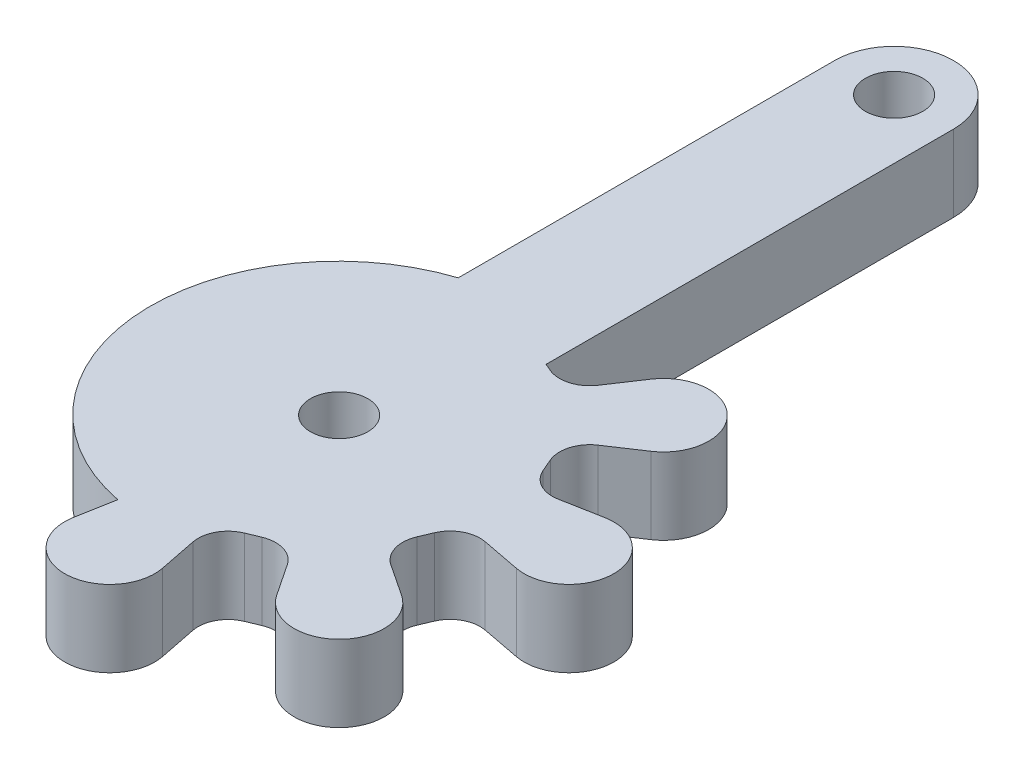
ISO-10303-21;
HEADER;
FILE_DESCRIPTION(('STEP AP214'),'2;1');
FILE_NAME('part.step','',(''),(''),'','','');
FILE_SCHEMA(('AUTOMOTIVE_DESIGN { 1 0 10303 214 1 1 1 1 }'));
ENDSEC;
DATA;
#1=APPLICATION_CONTEXT('core data for automotive mechanical design processes');
#2=APPLICATION_PROTOCOL_DEFINITION('international standard','automotive_design',2000,#1);
#3=PRODUCT_CONTEXT('',#1,'mechanical');
#4=PRODUCT('Part','Part','',(#3));
#5=PRODUCT_RELATED_PRODUCT_CATEGORY('part','',(#4));
#6=PRODUCT_DEFINITION_FORMATION('','',#4);
#7=PRODUCT_DEFINITION_CONTEXT('part definition',#1,'design');
#8=PRODUCT_DEFINITION('design','',#6,#7);
#9=PRODUCT_DEFINITION_SHAPE('','',#8);
#10=(LENGTH_UNIT() NAMED_UNIT(*) SI_UNIT(.MILLI.,.METRE.));
#11=(NAMED_UNIT(*) PLANE_ANGLE_UNIT() SI_UNIT($,.RADIAN.));
#12=(NAMED_UNIT(*) SI_UNIT($,.STERADIAN.) SOLID_ANGLE_UNIT());
#13=UNCERTAINTY_MEASURE_WITH_UNIT(LENGTH_MEASURE(1.E-05),#10,'distance_accuracy_value','');
#14=(GEOMETRIC_REPRESENTATION_CONTEXT(3) GLOBAL_UNCERTAINTY_ASSIGNED_CONTEXT((#13)) GLOBAL_UNIT_ASSIGNED_CONTEXT((#10,
#11,#12)) REPRESENTATION_CONTEXT('',''));
#15=CARTESIAN_POINT('',(0.,0.,0.));
#16=DIRECTION('',(0.,0.,1.));
#17=DIRECTION('',(1.,0.,0.));
#18=AXIS2_PLACEMENT_3D('',#15,#16,#17);
#19=CARTESIAN_POINT('',(-1.69733745490421,4.,8.84244731331642));
#20=DIRECTION('',(0.188511811401369,0.,-0.982070922572385));
#21=DIRECTION('',(-0.982070922572385,0.,-0.188511811401369));
#22=AXIS2_PLACEMENT_3D('',#19,#20,#21);
#23=PLANE('',#22);
#24=DIRECTION('',(0.982070922572385,0.,0.188511811401369));
#25=VECTOR('',#24,1.);
#26=CARTESIAN_POINT('',(-1.69733745490421,0.,8.84244731331642));
#27=LINE('',#26,#25);
#28=CARTESIAN_POINT('',(7.80303484135869,0.,10.6660756780223));
#29=VERTEX_POINT('',#28);
#30=CARTESIAN_POINT('',(9.82617716059361,0.,11.0544246399514));
#31=VERTEX_POINT('',#30);
#32=EDGE_CURVE('E272',#29,#31,#27,.T.);
#33=ORIENTED_EDGE('',*,*,#32,.T.);
#34=DIRECTION('',(0.,-1.,0.));
#35=VECTOR('',#34,1.);
#36=CARTESIAN_POINT('',(9.82617716059361,4.,11.0544246399514));
#37=LINE('',#36,#35);
#38=CARTESIAN_POINT('',(9.82617716059361,4.,11.0544246399514));
#39=VERTEX_POINT('',#38);
#40=EDGE_CURVE('E11',#39,#31,#37,.T.);
#41=ORIENTED_EDGE('',*,*,#40,.F.);
#42=DIRECTION('',(0.982070922572385,0.,0.188511811401369));
#43=VECTOR('',#42,1.);
#44=CARTESIAN_POINT('',(-1.69733745490421,4.,8.84244731331642));
#45=LINE('',#44,#43);
#46=CARTESIAN_POINT('',(7.80303484135869,4.,10.6660756780223));
#47=VERTEX_POINT('',#46);
#48=EDGE_CURVE('E706',#47,#39,#45,.T.);
#49=ORIENTED_EDGE('',*,*,#48,.F.);
#50=DIRECTION('',(0.,-1.,0.));
#51=VECTOR('',#50,1.);
#52=CARTESIAN_POINT('',(7.80303484135869,4.,10.6660756780223));
#53=LINE('',#52,#51);
#54=EDGE_CURVE('E63',#47,#29,#53,.T.);
#55=ORIENTED_EDGE('',*,*,#54,.T.);
#56=EDGE_LOOP('',(#33,#41,#49,#55));
#57=FACE_BOUND('',#56,.T.);
#58=ADVANCED_FACE('F41',(#57),#23,.F.);
#59=CARTESIAN_POINT('',(10.2679623897988,4.,8.75290080227204));
#60=DIRECTION('',(0.,-1.,0.));
#61=DIRECTION('',(0.,0.,-1.));
#62=AXIS2_PLACEMENT_3D('',#59,#60,#61);
#63=CYLINDRICAL_SURFACE('',#62,2.34354137239997);
#64=CARTESIAN_POINT('',(10.2679623897988,0.,8.75290080227204));
#65=DIRECTION('',(0.,1.,0.));
#66=DIRECTION('',(0.,0.,1.));
#67=AXIS2_PLACEMENT_3D('',#64,#65,#66);
#68=CIRCLE('',#67,2.34354137239997);
#69=CARTESIAN_POINT('',(9.83705937168976,0.,6.44931473851516));
#70=VERTEX_POINT('',#69);
#71=EDGE_CURVE('E275',#31,#70,#68,.T.);
#72=ORIENTED_EDGE('',*,*,#71,.T.);
#73=DIRECTION('',(0.,-1.,0.));
#74=VECTOR('',#73,1.);
#75=CARTESIAN_POINT('',(9.83705937168976,4.,6.44931473851516));
#76=LINE('',#75,#74);
#77=CARTESIAN_POINT('',(9.83705937168976,4.,6.44931473851516));
#78=VERTEX_POINT('',#77);
#79=EDGE_CURVE('E54',#78,#70,#76,.T.);
#80=ORIENTED_EDGE('',*,*,#79,.F.);
#81=CARTESIAN_POINT('',(10.2679623897988,4.,8.75290080227204));
#82=DIRECTION('',(0.,1.,0.));
#83=DIRECTION('',(0.,0.,1.));
#84=AXIS2_PLACEMENT_3D('',#81,#82,#83);
#85=CIRCLE('',#84,2.34354137239997);
#86=EDGE_CURVE('E159',#39,#78,#85,.T.);
#87=ORIENTED_EDGE('',*,*,#86,.F.);
#88=ORIENTED_EDGE('',*,*,#40,.T.);
#89=EDGE_LOOP('',(#72,#80,#87,#88));
#90=FACE_BOUND('',#89,.T.);
#91=ADVANCED_FACE('F484',(#90),#63,.T.);
#92=CARTESIAN_POINT('',(1.49817438317771,4.,8.00916560137101));
#93=DIRECTION('',(-0.183868321329332,0.,-0.982950884028054));
#94=DIRECTION('',(-0.982950884028055,0.,0.183868321329332));
#95=AXIS2_PLACEMENT_3D('',#92,#93,#94);
#96=PLANE('',#95);
#97=DIRECTION('',(0.982950884028054,0.,-0.183868321329332));
#98=VECTOR('',#97,1.);
#99=CARTESIAN_POINT('',(1.49817438317771,0.,8.00916560137101));
#100=LINE('',#99,#98);
#101=CARTESIAN_POINT('',(7.78319010426754,0.,6.83350636046405));
#102=VERTEX_POINT('',#101);
#103=EDGE_CURVE('E279',#102,#70,#100,.T.);
#104=ORIENTED_EDGE('',*,*,#103,.F.);
#105=DIRECTION('',(0.,-1.,0.));
#106=VECTOR('',#105,1.);
#107=CARTESIAN_POINT('',(7.78319010426754,4.,6.83350636046405));
#108=LINE('',#107,#106);
#109=CARTESIAN_POINT('',(7.78319010426754,4.,6.83350636046405));
#110=VERTEX_POINT('',#109);
#111=EDGE_CURVE('E445',#110,#102,#108,.T.);
#112=ORIENTED_EDGE('',*,*,#111,.F.);
#113=DIRECTION('',(0.982950884028054,0.,-0.183868321329332));
#114=VECTOR('',#113,1.);
#115=CARTESIAN_POINT('',(1.49817438317771,4.,8.00916560137101));
#116=LINE('',#115,#114);
#117=EDGE_CURVE('E700',#110,#78,#116,.T.);
#118=ORIENTED_EDGE('',*,*,#117,.T.);
#119=ORIENTED_EDGE('',*,*,#79,.T.);
#120=EDGE_LOOP('',(#104,#112,#118,#119));
#121=FACE_BOUND('',#120,.T.);
#122=ADVANCED_FACE('F480',(#121),#96,.T.);
#123=CARTESIAN_POINT('',(7.50115811767319,4.,5.32577741323252));
#124=DIRECTION('',(0.,-1.,0.));
#125=DIRECTION('',(0.,0.,-1.));
#126=AXIS2_PLACEMENT_3D('',#123,#124,#125);
#127=CYLINDRICAL_SURFACE('',#126,1.5338802494922);
#128=CARTESIAN_POINT('',(7.50115811767319,0.,5.32577741323252));
#129=DIRECTION('',(0.,1.,0.));
#130=DIRECTION('',(0.,0.,1.));
#131=AXIS2_PLACEMENT_3D('',#128,#129,#130);
#132=CIRCLE('',#131,1.5338802494922);
#133=CARTESIAN_POINT('',(6.09153989642403,0.,5.93056257352054));
#134=VERTEX_POINT('',#133);
#135=EDGE_CURVE('E283',#134,#102,#132,.T.);
#136=ORIENTED_EDGE('',*,*,#135,.F.);
#137=DIRECTION('',(0.,-1.,0.));
#138=VECTOR('',#137,1.);
#139=CARTESIAN_POINT('',(6.09153989642403,4.,5.93056257352054));
#140=LINE('',#139,#138);
#141=CARTESIAN_POINT('',(6.09153989642403,4.,5.93056257352054));
#142=VERTEX_POINT('',#141);
#143=EDGE_CURVE('E442',#142,#134,#140,.T.);
#144=ORIENTED_EDGE('',*,*,#143,.F.);
#145=CARTESIAN_POINT('',(7.50115811767319,4.,5.32577741323252));
#146=DIRECTION('',(0.,1.,0.));
#147=DIRECTION('',(0.,0.,1.));
#148=AXIS2_PLACEMENT_3D('',#145,#146,#147);
#149=CIRCLE('',#148,1.5338802494922);
#150=EDGE_CURVE('E696',#142,#110,#149,.T.);
#151=ORIENTED_EDGE('',*,*,#150,.T.);
#152=ORIENTED_EDGE('',*,*,#111,.T.);
#153=EDGE_LOOP('',(#136,#144,#151,#152));
#154=FACE_BOUND('',#153,.T.);
#155=ADVANCED_FACE('F476',(#154),#127,.F.);
#156=CARTESIAN_POINT('',(2.99565055921617,4.,-1.2852593534276));
#157=DIRECTION('',(-0.918988442361013,0.,0.394284469395993));
#158=DIRECTION('',(0.394284469395993,0.,0.918988442361013));
#159=AXIS2_PLACEMENT_3D('',#156,#157,#158);
#160=PLANE('',#159);
#161=DIRECTION('',(-0.394284469395993,0.,-0.918988442361013));
#162=VECTOR('',#161,1.);
#163=CARTESIAN_POINT('',(2.99565055921617,0.,-1.2852593534276));
#164=LINE('',#163,#162);
#165=CARTESIAN_POINT('',(5.80885789960431,0.,5.27169440065333));
#166=VERTEX_POINT('',#165);
#167=EDGE_CURVE('E287',#134,#166,#164,.T.);
#168=ORIENTED_EDGE('',*,*,#167,.T.);
#169=DIRECTION('',(0.,-1.,0.));
#170=VECTOR('',#169,1.);
#171=CARTESIAN_POINT('',(5.80885789960431,4.,5.27169440065333));
#172=LINE('',#171,#170);
#173=CARTESIAN_POINT('',(5.80885789960431,4.,5.27169440065333));
#174=VERTEX_POINT('',#173);
#175=EDGE_CURVE('E439',#174,#166,#172,.T.);
#176=ORIENTED_EDGE('',*,*,#175,.F.);
#177=DIRECTION('',(-0.394284469395993,0.,-0.918988442361013));
#178=VECTOR('',#177,1.);
#179=CARTESIAN_POINT('',(2.99565055921617,4.,-1.2852593534276));
#180=LINE('',#179,#178);
#181=EDGE_CURVE('E693',#142,#174,#180,.T.);
#182=ORIENTED_EDGE('',*,*,#181,.F.);
#183=ORIENTED_EDGE('',*,*,#143,.T.);
#184=EDGE_LOOP('',(#168,#176,#182,#183));
#185=FACE_BOUND('',#184,.T.);
#186=ADVANCED_FACE('F472',(#185),#160,.F.);
#187=CARTESIAN_POINT('',(7.25105911370526,4.,4.65292977396973));
#188=DIRECTION('',(0.,-1.,0.));
#189=DIRECTION('',(0.,0.,-1.));
#190=AXIS2_PLACEMENT_3D('',#187,#188,#189);
#191=CYLINDRICAL_SURFACE('',#190,1.56933552983074);
#192=CARTESIAN_POINT('',(7.25105911370526,0.,4.65292977396973));
#193=DIRECTION('',(0.,1.,0.));
#194=DIRECTION('',(0.,0.,1.));
#195=AXIS2_PLACEMENT_3D('',#192,#193,#194);
#196=CIRCLE('',#195,1.56933552983074);
#197=CARTESIAN_POINT('',(6.38084940364108,0.,3.34696305699118));
#198=VERTEX_POINT('',#197);
#199=EDGE_CURVE('E291',#198,#166,#196,.T.);
#200=ORIENTED_EDGE('',*,*,#199,.F.);
#201=CARTESIAN_POINT('',(6.38084940364108,4.,3.34696305699118));
#202=DIRECTION('',(0.,-1.,0.));
#203=VECTOR('',#202,1.);
#204=LINE('',#201,#203);
#205=CARTESIAN_POINT('',(6.38084940364108,4.,3.34696305699118));
#206=VERTEX_POINT('',#205);
#207=EDGE_CURVE('E438',#206,#198,#204,.T.);
#208=ORIENTED_EDGE('',*,*,#207,.F.);
#209=CARTESIAN_POINT('',(7.25105911370526,4.,4.65292977396973));
#210=DIRECTION('',(0.,1.,0.));
#211=DIRECTION('',(0.,0.,1.));
#212=AXIS2_PLACEMENT_3D('',#209,#210,#211);
#213=CIRCLE('',#212,1.56933552983074);
#214=EDGE_CURVE('E687',#206,#174,#213,.T.);
#215=ORIENTED_EDGE('',*,*,#214,.T.);
#216=ORIENTED_EDGE('',*,*,#175,.T.);
#217=EDGE_LOOP('',(#200,#208,#215,#216));
#218=FACE_BOUND('',#217,.T.);
#219=ADVANCED_FACE('F467',(#218),#191,.F.);
#220=CARTESIAN_POINT('',(3.50637874743044,4.,5.26228679560961));
#221=DIRECTION('',(-0.554501749597017,0.,-0.832182557912534));
#222=DIRECTION('',(-0.832182557912534,0.,0.554501749597017));
#223=AXIS2_PLACEMENT_3D('',#220,#221,#222);
#224=PLANE('',#223);
#225=DIRECTION('',(0.832182557912534,0.,-0.554501749597017));
#226=VECTOR('',#225,1.);
#227=CARTESIAN_POINT('',(3.50637874743044,0.,5.26228679560961));
#228=LINE('',#227,#226);
#229=CARTESIAN_POINT('',(8.04587564062374,0.,2.23751903806372));
#230=VERTEX_POINT('',#229);
#231=EDGE_CURVE('E295',#198,#230,#228,.T.);
#232=ORIENTED_EDGE('',*,*,#231,.T.);
#233=DIRECTION('',(0.,-1.,0.));
#234=VECTOR('',#233,1.);
#235=CARTESIAN_POINT('',(8.04587564062374,4.,2.23751903806372));
#236=LINE('',#235,#234);
#237=CARTESIAN_POINT('',(8.04587564062374,4.,2.23751903806372));
#238=VERTEX_POINT('',#237);
#239=EDGE_CURVE('E434',#238,#230,#236,.T.);
#240=ORIENTED_EDGE('',*,*,#239,.F.);
#241=DIRECTION('',(0.832182557912534,0.,-0.554501749597017));
#242=VECTOR('',#241,1.);
#243=CARTESIAN_POINT('',(3.50637874743044,4.,5.26228679560961));
#244=LINE('',#243,#242);
#245=EDGE_CURVE('E682',#206,#238,#244,.T.);
#246=ORIENTED_EDGE('',*,*,#245,.F.);
#247=ORIENTED_EDGE('',*,*,#207,.T.);
#248=EDGE_LOOP('',(#232,#240,#246,#247));
#249=FACE_BOUND('',#248,.T.);
#250=ADVANCED_FACE('F457',(#249),#224,.F.);
#251=CARTESIAN_POINT('',(6.7406049641069,4.,0.278600980291283));
#252=DIRECTION('',(0.,-1.,0.));
#253=DIRECTION('',(0.,0.,-1.));
#254=AXIS2_PLACEMENT_3D('',#251,#252,#253);
#255=CYLINDRICAL_SURFACE('',#254,2.35395231388438);
#256=CARTESIAN_POINT('',(6.7406049641069,0.,0.278600980291283));
#257=DIRECTION('',(0.,1.,0.));
#258=DIRECTION('',(0.,0.,1.));
#259=AXIS2_PLACEMENT_3D('',#256,#257,#258);
#260=CIRCLE('',#259,2.35395231388438);
#261=CARTESIAN_POINT('',(4.78116826774431,0.,-1.02589100089882));
#262=VERTEX_POINT('',#261);
#263=EDGE_CURVE('E300',#230,#262,#260,.T.);
#264=ORIENTED_EDGE('',*,*,#263,.T.);
#265=DIRECTION('',(0.,-1.,0.));
#266=VECTOR('',#265,1.);
#267=CARTESIAN_POINT('',(4.78116826774431,4.,-1.02589100089882));
#268=LINE('',#267,#266);
#269=CARTESIAN_POINT('',(4.78116826774431,4.,-1.02589100089882));
#270=VERTEX_POINT('',#269);
#271=EDGE_CURVE('E431',#270,#262,#268,.T.);
#272=ORIENTED_EDGE('',*,*,#271,.F.);
#273=CARTESIAN_POINT('',(6.7406049641069,4.,0.278600980291283));
#274=DIRECTION('',(0.,1.,0.));
#275=DIRECTION('',(0.,0.,1.));
#276=AXIS2_PLACEMENT_3D('',#273,#274,#275);
#277=CIRCLE('',#276,2.35395231388438);
#278=EDGE_CURVE('E607',#238,#270,#277,.T.);
#279=ORIENTED_EDGE('',*,*,#278,.F.);
#280=ORIENTED_EDGE('',*,*,#239,.T.);
#281=EDGE_LOOP('',(#264,#272,#279,#280));
#282=FACE_BOUND('',#281,.T.);
#283=ADVANCED_FACE('F466',(#282),#255,.T.);
#284=CARTESIAN_POINT('',(2.83960864986372,4.,1.89046511190777));
#285=DIRECTION('',(-0.832402884631601,0.,-0.554170946240409));
#286=DIRECTION('',(-0.554170946240409,0.,0.832402884631601));
#287=AXIS2_PLACEMENT_3D('',#284,#285,#286);
#288=PLANE('',#287);
#289=DIRECTION('',(0.554170946240409,0.,-0.832402884631601));
#290=VECTOR('',#289,1.);
#291=CARTESIAN_POINT('',(2.83960864986372,0.,1.89046511190777));
#292=LINE('',#291,#290);
#293=CARTESIAN_POINT('',(3.67533450598089,0.,0.635147383483667));
#294=VERTEX_POINT('',#293);
#295=EDGE_CURVE('E306',#294,#262,#292,.T.);
#296=ORIENTED_EDGE('',*,*,#295,.F.);
#297=DIRECTION('',(0.,-1.,0.));
#298=VECTOR('',#297,1.);
#299=CARTESIAN_POINT('',(3.67533450598089,4.,0.635147383483667));
#300=LINE('',#299,#298);
#301=CARTESIAN_POINT('',(3.67533450598089,4.,0.635147383483667));
#302=VERTEX_POINT('',#301);
#303=EDGE_CURVE('E428',#302,#294,#300,.T.);
#304=ORIENTED_EDGE('',*,*,#303,.F.);
#305=DIRECTION('',(0.554170946240409,0.,-0.832402884631601));
#306=VECTOR('',#305,1.);
#307=CARTESIAN_POINT('',(2.83960864986372,4.,1.89046511190777));
#308=LINE('',#307,#306);
#309=EDGE_CURVE('E601',#302,#270,#308,.T.);
#310=ORIENTED_EDGE('',*,*,#309,.T.);
#311=ORIENTED_EDGE('',*,*,#271,.T.);
#312=EDGE_LOOP('',(#296,#304,#310,#311));
#313=FACE_BOUND('',#312,.T.);
#314=ADVANCED_FACE('F579',(#313),#288,.T.);
#315=CARTESIAN_POINT('',(2.36286212740478,4.,-0.238629093482552));
#316=DIRECTION('',(0.,-1.,0.));
#317=DIRECTION('',(0.,0.,-1.));
#318=AXIS2_PLACEMENT_3D('',#315,#316,#317);
#319=CYLINDRICAL_SURFACE('',#318,1.57672733096903);
#320=CARTESIAN_POINT('',(2.36286212740478,0.,-0.238629093482552));
#321=DIRECTION('',(0.,1.,0.));
#322=DIRECTION('',(0.,0.,1.));
#323=AXIS2_PLACEMENT_3D('',#320,#321,#322);
#324=CIRCLE('',#323,1.57672733096903);
#325=CARTESIAN_POINT('',(1.66926702337543,0.,1.17734933428082));
#326=VERTEX_POINT('',#325);
#327=EDGE_CURVE('E310',#326,#294,#324,.T.);
#328=ORIENTED_EDGE('',*,*,#327,.F.);
#329=DIRECTION('',(0.,-1.,0.));
#330=VECTOR('',#329,1.);
#331=CARTESIAN_POINT('',(1.66926702337543,4.,1.17734933428082));
#332=LINE('',#331,#330);
#333=CARTESIAN_POINT('',(1.66926702337543,4.,1.17734933428082));
#334=VERTEX_POINT('',#333);
#335=EDGE_CURVE('E425',#334,#326,#332,.T.);
#336=ORIENTED_EDGE('',*,*,#335,.F.);
#337=CARTESIAN_POINT('',(2.36286212740478,4.,-0.238629093482552));
#338=DIRECTION('',(0.,1.,0.));
#339=DIRECTION('',(0.,0.,1.));
#340=AXIS2_PLACEMENT_3D('',#337,#338,#339);
#341=CIRCLE('',#340,1.57672733096903);
#342=EDGE_CURVE('E596',#334,#302,#341,.T.);
#343=ORIENTED_EDGE('',*,*,#342,.T.);
#344=ORIENTED_EDGE('',*,*,#303,.T.);
#345=EDGE_LOOP('',(#328,#336,#343,#344));
#346=FACE_BOUND('',#345,.T.);
#347=ADVANCED_FACE('F576',(#346),#319,.F.);
#348=CARTESIAN_POINT('',(-0.168041698752904,4.,0.394269459049429));
#349=DIRECTION('',(0.392083475866546,0.,-0.919929642936028));
#350=DIRECTION('',(-0.919929642936028,0.,-0.392083475866546));
#351=AXIS2_PLACEMENT_3D('',#348,#349,#350);
#352=PLANE('',#351);
#353=DIRECTION('',(0.919929642936028,0.,0.392083475866546));
#354=VECTOR('',#353,1.);
#355=CARTESIAN_POINT('',(-0.168041698752904,0.,0.394269459049429));
#356=LINE('',#355,#354);
#357=CARTESIAN_POINT('',(1.36734479974239,0.,1.048666977111));
#358=VERTEX_POINT('',#357);
#359=EDGE_CURVE('E314',#358,#326,#356,.T.);
#360=ORIENTED_EDGE('',*,*,#359,.F.);
#361=DIRECTION('',(0.,-1.,0.));
#362=VECTOR('',#361,1.);
#363=CARTESIAN_POINT('',(1.36734479974239,4.,1.048666977111));
#364=LINE('',#363,#362);
#365=CARTESIAN_POINT('',(1.36734479974239,4.,1.048666977111));
#366=VERTEX_POINT('',#365);
#367=EDGE_CURVE('E422',#366,#358,#364,.T.);
#368=ORIENTED_EDGE('',*,*,#367,.F.);
#369=DIRECTION('',(0.919929642936028,0.,0.392083475866546));
#370=VECTOR('',#369,1.);
#371=CARTESIAN_POINT('',(-0.168041698752904,4.,0.394269459049429));
#372=LINE('',#371,#370);
#373=EDGE_CURVE('E600',#366,#334,#372,.T.);
#374=ORIENTED_EDGE('',*,*,#373,.T.);
#375=ORIENTED_EDGE('',*,*,#335,.T.);
#376=EDGE_LOOP('',(#360,#368,#374,#375));
#377=FACE_BOUND('',#376,.T.);
#378=ADVANCED_FACE('F572',(#377),#352,.T.);
#379=CARTESIAN_POINT('',(1.36734479974239,4.,0.));
#380=DIRECTION('',(1.,0.,0.));
#381=DIRECTION('',(0.,0.,-1.));
#382=AXIS2_PLACEMENT_3D('',#379,#380,#381);
#383=PLANE('',#382);
#384=DIRECTION('',(0.,0.,1.));
#385=VECTOR('',#384,1.);
#386=CARTESIAN_POINT('',(1.36734479974239,0.,0.));
#387=LINE('',#386,#385);
#388=CARTESIAN_POINT('',(1.36734479974239,0.,-20.2426364699993));
#389=VERTEX_POINT('',#388);
#390=EDGE_CURVE('E318',#389,#358,#387,.T.);
#391=ORIENTED_EDGE('',*,*,#390,.F.);
#392=DIRECTION('',(0.,-1.,0.));
#393=VECTOR('',#392,1.);
#394=CARTESIAN_POINT('',(1.36734479974239,4.,-20.2426364699993));
#395=LINE('',#394,#393);
#396=CARTESIAN_POINT('',(1.36734479974239,4.,-20.2426364699993));
#397=VERTEX_POINT('',#396);
#398=EDGE_CURVE('E419',#397,#389,#395,.T.);
#399=ORIENTED_EDGE('',*,*,#398,.F.);
#400=DIRECTION('',(0.,0.,1.));
#401=VECTOR('',#400,1.);
#402=CARTESIAN_POINT('',(1.36734479974239,4.,0.));
#403=LINE('',#402,#401);
#404=EDGE_CURVE('E605',#397,#366,#403,.T.);
#405=ORIENTED_EDGE('',*,*,#404,.T.);
#406=ORIENTED_EDGE('',*,*,#367,.T.);
#407=EDGE_LOOP('',(#391,#399,#405,#406));
#408=FACE_BOUND('',#407,.T.);
#409=ADVANCED_FACE('F568',(#408),#383,.T.);
#410=CARTESIAN_POINT('',(-1.73765498091237,4.,-20.2426364699993));
#411=DIRECTION('',(0.,-1.,0.));
#412=DIRECTION('',(0.,0.,-1.));
#413=AXIS2_PLACEMENT_3D('',#410,#411,#412);
#414=CYLINDRICAL_SURFACE('',#413,3.104999780655);
#415=CARTESIAN_POINT('',(-1.73765498091237,0.,-20.2426364699993));
#416=DIRECTION('',(0.,1.,0.));
#417=DIRECTION('',(0.,0.,1.));
#418=AXIS2_PLACEMENT_3D('',#415,#416,#417);
#419=CIRCLE('',#418,3.104999780655);
#420=CARTESIAN_POINT('',(-4.84265476156761,0.,-20.2426364699993));
#421=VERTEX_POINT('',#420);
#422=EDGE_CURVE('E322',#389,#421,#419,.T.);
#423=ORIENTED_EDGE('',*,*,#422,.T.);
#424=DIRECTION('',(0.,-1.,0.));
#425=VECTOR('',#424,1.);
#426=CARTESIAN_POINT('',(-4.84265476156761,4.,-20.2426364699993));
#427=LINE('',#426,#425);
#428=CARTESIAN_POINT('',(-4.84265476156761,4.,-20.2426364699993));
#429=VERTEX_POINT('',#428);
#430=EDGE_CURVE('E416',#429,#421,#427,.T.);
#431=ORIENTED_EDGE('',*,*,#430,.F.);
#432=CARTESIAN_POINT('',(-1.73765498091237,4.,-20.2426364699993));
#433=DIRECTION('',(0.,1.,0.));
#434=DIRECTION('',(0.,0.,1.));
#435=AXIS2_PLACEMENT_3D('',#432,#433,#434);
#436=CIRCLE('',#435,3.104999780655);
#437=EDGE_CURVE('E614',#397,#429,#436,.T.);
#438=ORIENTED_EDGE('',*,*,#437,.F.);
#439=ORIENTED_EDGE('',*,*,#398,.T.);
#440=EDGE_LOOP('',(#423,#431,#438,#439));
#441=FACE_BOUND('',#440,.T.);
#442=ADVANCED_FACE('F564',(#441),#414,.T.);
#443=CARTESIAN_POINT('',(-4.84265476156761,4.,0.));
#444=DIRECTION('',(-1.,0.,0.));
#445=DIRECTION('',(0.,0.,1.));
#446=AXIS2_PLACEMENT_3D('',#443,#444,#445);
#447=PLANE('',#446);
#448=DIRECTION('',(0.,0.,-1.));
#449=VECTOR('',#448,1.);
#450=CARTESIAN_POINT('',(-4.84265476156761,0.,0.));
#451=LINE('',#450,#449);
#452=CARTESIAN_POINT('',(-4.84265476156761,0.,-0.571999526795004));
#453=VERTEX_POINT('',#452);
#454=EDGE_CURVE('E326',#453,#421,#451,.T.);
#455=ORIENTED_EDGE('',*,*,#454,.F.);
#456=DIRECTION('',(0.,-1.,0.));
#457=VECTOR('',#456,1.);
#458=CARTESIAN_POINT('',(-4.84265476156761,4.,-0.571999526795004));
#459=LINE('',#458,#457);
#460=CARTESIAN_POINT('',(-4.84265476156761,4.,-0.571999526795004));
#461=VERTEX_POINT('',#460);
#462=EDGE_CURVE('E413',#461,#453,#459,.T.);
#463=ORIENTED_EDGE('',*,*,#462,.F.);
#464=DIRECTION('',(0.,0.,-1.));
#465=VECTOR('',#464,1.);
#466=CARTESIAN_POINT('',(-4.84265476156761,4.,0.));
#467=LINE('',#466,#465);
#468=EDGE_CURVE('E617',#461,#429,#467,.T.);
#469=ORIENTED_EDGE('',*,*,#468,.T.);
#470=ORIENTED_EDGE('',*,*,#430,.T.);
#471=EDGE_LOOP('',(#455,#463,#469,#470));
#472=FACE_BOUND('',#471,.T.);
#473=ADVANCED_FACE('F560',(#472),#447,.T.);
#474=CARTESIAN_POINT('',(-1.80876623057724,4.,8.74696422161268));
#475=DIRECTION('',(0.,-1.,0.));
#476=DIRECTION('',(0.,0.,-1.));
#477=AXIS2_PLACEMENT_3D('',#474,#475,#476);
#478=CYLINDRICAL_SURFACE('',#477,9.80038595987992);
#479=CARTESIAN_POINT('',(-1.80876623057724,0.,8.74696422161268));
#480=DIRECTION('',(0.,1.,0.));
#481=DIRECTION('',(0.,0.,1.));
#482=AXIS2_PLACEMENT_3D('',#479,#480,#481);
#483=CIRCLE('',#482,9.80038595987992);
#484=CARTESIAN_POINT('',(-3.69826202125276,0.,18.3634797350214));
#485=VERTEX_POINT('',#484);
#486=EDGE_CURVE('E330',#453,#485,#483,.T.);
#487=ORIENTED_EDGE('',*,*,#486,.T.);
#488=DIRECTION('',(0.,-1.,0.));
#489=VECTOR('',#488,1.);
#490=CARTESIAN_POINT('',(-3.69826202125276,4.,18.3634797350214));
#491=LINE('',#490,#489);
#492=CARTESIAN_POINT('',(-3.69826202125276,4.,18.3634797350214));
#493=VERTEX_POINT('',#492);
#494=EDGE_CURVE('E409',#493,#485,#491,.T.);
#495=ORIENTED_EDGE('',*,*,#494,.F.);
#496=CARTESIAN_POINT('',(-1.80876623057724,4.,8.74696422161268));
#497=DIRECTION('',(0.,1.,0.));
#498=DIRECTION('',(0.,0.,1.));
#499=AXIS2_PLACEMENT_3D('',#496,#497,#498);
#500=CIRCLE('',#499,9.80038595987992);
#501=EDGE_CURVE('E621',#461,#493,#500,.T.);
#502=ORIENTED_EDGE('',*,*,#501,.F.);
#503=ORIENTED_EDGE('',*,*,#462,.T.);
#504=EDGE_LOOP('',(#487,#495,#502,#503));
#505=FACE_BOUND('',#504,.T.);
#506=ADVANCED_FACE('F556',(#505),#478,.T.);
#507=CARTESIAN_POINT('',(-0.359254316927901,4.,-0.0650920184202662));
#508=DIRECTION('',(0.983979127656891,0.,0.178283696213604));
#509=DIRECTION('',(0.178283696213604,0.,-0.983979127656891));
#510=AXIS2_PLACEMENT_3D('',#507,#508,#509);
#511=PLANE('',#510);
#512=DIRECTION('',(-0.178283696213604,0.,0.983979127656891));
#513=VECTOR('',#512,1.);
#514=CARTESIAN_POINT('',(-0.359254316927901,0.,-0.0650920184202662));
#515=LINE('',#514,#513);
#516=CARTESIAN_POINT('',(-4.05389518785656,0.,20.3262818334332));
#517=VERTEX_POINT('',#516);
#518=EDGE_CURVE('E333',#485,#517,#515,.T.);
#519=ORIENTED_EDGE('',*,*,#518,.T.);
#520=DIRECTION('',(0.,-1.,0.));
#521=VECTOR('',#520,1.);
#522=CARTESIAN_POINT('',(-4.05389518785656,4.,20.3262818334332));
#523=LINE('',#522,#521);
#524=CARTESIAN_POINT('',(-4.05389518785656,4.,20.3262818334332));
#525=VERTEX_POINT('',#524);
#526=EDGE_CURVE('E405',#525,#517,#523,.T.);
#527=ORIENTED_EDGE('',*,*,#526,.F.);
#528=DIRECTION('',(-0.178283696213604,0.,0.983979127656891));
#529=VECTOR('',#528,1.);
#530=CARTESIAN_POINT('',(-0.359254316927901,4.,-0.0650920184202662));
#531=LINE('',#530,#529);
#532=EDGE_CURVE('E624',#493,#525,#531,.T.);
#533=ORIENTED_EDGE('',*,*,#532,.F.);
#534=ORIENTED_EDGE('',*,*,#494,.T.);
#535=EDGE_LOOP('',(#519,#527,#533,#534));
#536=FACE_BOUND('',#535,.T.);
#537=ADVANCED_FACE('F552',(#536),#511,.F.);
#538=CARTESIAN_POINT('',(-1.73765541560675,4.,20.7459531214787));
#539=DIRECTION('',(0.,-1.,0.));
#540=DIRECTION('',(0.,0.,-1.));
#541=AXIS2_PLACEMENT_3D('',#538,#539,#540);
#542=CYLINDRICAL_SURFACE('',#541,2.35395213897003);
#543=CARTESIAN_POINT('',(-1.73765541560675,0.,20.7459531214787));
#544=DIRECTION('',(0.,1.,0.));
#545=DIRECTION('',(0.,0.,1.));
#546=AXIS2_PLACEMENT_3D('',#543,#544,#545);
#547=CIRCLE('',#546,2.35395213897003);
#548=CARTESIAN_POINT('',(0.570509604468042,0.,20.283930489279));
#549=VERTEX_POINT('',#548);
#550=EDGE_CURVE('E336',#517,#549,#547,.T.);
#551=ORIENTED_EDGE('',*,*,#550,.T.);
#552=DIRECTION('',(0.,-1.,0.));
#553=VECTOR('',#552,1.);
#554=CARTESIAN_POINT('',(0.570509604468042,4.,20.283930489279));
#555=LINE('',#554,#553);
#556=CARTESIAN_POINT('',(0.570509604468042,4.,20.283930489279));
#557=VERTEX_POINT('',#556);
#558=EDGE_CURVE('E402',#557,#549,#555,.T.);
#559=ORIENTED_EDGE('',*,*,#558,.F.);
#560=CARTESIAN_POINT('',(-1.73765541560675,4.,20.7459531214787));
#561=DIRECTION('',(0.,1.,0.));
#562=DIRECTION('',(0.,0.,1.));
#563=AXIS2_PLACEMENT_3D('',#560,#561,#562);
#564=CIRCLE('',#563,2.35395213897003);
#565=EDGE_CURVE('E627',#525,#557,#564,.T.);
#566=ORIENTED_EDGE('',*,*,#565,.F.);
#567=ORIENTED_EDGE('',*,*,#526,.T.);
#568=EDGE_LOOP('',(#551,#559,#566,#567));
#569=FACE_BOUND('',#568,.T.);
#570=ADVANCED_FACE('F548',(#569),#542,.T.);
#571=CARTESIAN_POINT('',(-3.35526332629943,4.,0.671619048143178));
#572=DIRECTION('',(0.980548831840193,0.,-0.196275287229019));
#573=DIRECTION('',(-0.196275287229019,0.,-0.980548831840193));
#574=AXIS2_PLACEMENT_3D('',#571,#572,#573);
#575=PLANE('',#574);
#576=DIRECTION('',(0.196275287229019,0.,0.980548831840193));
#577=VECTOR('',#576,1.);
#578=CARTESIAN_POINT('',(-3.35526332629943,0.,0.671619048143178));
#579=LINE('',#578,#577);
#580=CARTESIAN_POINT('',(0.177742698947966,0.,18.3217520824588));
#581=VERTEX_POINT('',#580);
#582=EDGE_CURVE('E340',#581,#549,#579,.T.);
#583=ORIENTED_EDGE('',*,*,#582,.F.);
#584=DIRECTION('',(0.,-1.,0.));
#585=VECTOR('',#584,1.);
#586=CARTESIAN_POINT('',(0.177742698947966,4.,18.3217520824588));
#587=LINE('',#586,#585);
#588=CARTESIAN_POINT('',(0.177742698947966,4.,18.3217520824588));
#589=VERTEX_POINT('',#588);
#590=EDGE_CURVE('E399',#589,#581,#587,.T.);
#591=ORIENTED_EDGE('',*,*,#590,.F.);
#592=DIRECTION('',(0.196275287229019,0.,0.980548831840193));
#593=VECTOR('',#592,1.);
#594=CARTESIAN_POINT('',(-3.35526332629943,4.,0.671619048143178));
#595=LINE('',#594,#593);
#596=EDGE_CURVE('E630',#589,#557,#595,.T.);
#597=ORIENTED_EDGE('',*,*,#596,.T.);
#598=ORIENTED_EDGE('',*,*,#558,.T.);
#599=EDGE_LOOP('',(#583,#591,#597,#598));
#600=FACE_BOUND('',#599,.T.);
#601=ADVANCED_FACE('F544',(#600),#575,.T.);
#602=CARTESIAN_POINT('',(1.71652099396005,4.,18.0137366710606));
#603=DIRECTION('',(0.,-1.,0.));
#604=DIRECTION('',(0.,0.,-1.));
#605=AXIS2_PLACEMENT_3D('',#602,#603,#604);
#606=CYLINDRICAL_SURFACE('',#605,1.56930307297829);
#607=CARTESIAN_POINT('',(1.71652099396005,0.,18.0137366710606));
#608=DIRECTION('',(0.,1.,0.));
#609=DIRECTION('',(0.,0.,1.));
#610=AXIS2_PLACEMENT_3D('',#607,#608,#609);
#611=CIRCLE('',#610,1.56930307297829);
#612=CARTESIAN_POINT('',(1.11441094197481,0.,16.5645384029974));
#613=VERTEX_POINT('',#612);
#614=EDGE_CURVE('E344',#613,#581,#611,.T.);
#615=ORIENTED_EDGE('',*,*,#614,.F.);
#616=DIRECTION('',(0.,-1.,0.));
#617=VECTOR('',#616,1.);
#618=CARTESIAN_POINT('',(1.11441094197481,4.,16.5645384029974));
#619=LINE('',#618,#617);
#620=CARTESIAN_POINT('',(1.11441094197481,4.,16.5645384029974));
#621=VERTEX_POINT('',#620);
#622=EDGE_CURVE('E396',#621,#613,#619,.T.);
#623=ORIENTED_EDGE('',*,*,#622,.F.);
#624=CARTESIAN_POINT('',(1.71652099396005,4.,18.0137366710606));
#625=DIRECTION('',(0.,1.,0.));
#626=DIRECTION('',(0.,0.,1.));
#627=AXIS2_PLACEMENT_3D('',#624,#625,#626);
#628=CIRCLE('',#627,1.56930307297829);
#629=EDGE_CURVE('E634',#621,#589,#628,.T.);
#630=ORIENTED_EDGE('',*,*,#629,.T.);
#631=ORIENTED_EDGE('',*,*,#590,.T.);
#632=EDGE_LOOP('',(#615,#623,#630,#631));
#633=FACE_BOUND('',#632,.T.);
#634=ADVANCED_FACE('F540',(#633),#606,.F.);
#635=CARTESIAN_POINT('',(6.03312384714608,4.,14.5209212194141));
#636=DIRECTION('',(-0.38367990374385,0.,-0.923466150686158));
#637=DIRECTION('',(-0.923466150686158,0.,0.38367990374385));
#638=AXIS2_PLACEMENT_3D('',#635,#636,#637);
#639=PLANE('',#638);
#640=DIRECTION('',(0.923466150686158,0.,-0.38367990374385));
#641=VECTOR('',#640,1.);
#642=CARTESIAN_POINT('',(6.03312384714608,0.,14.5209212194141));
#643=LINE('',#642,#641);
#644=CARTESIAN_POINT('',(1.7629910632753,0.,16.2950676072072));
#645=VERTEX_POINT('',#644);
#646=EDGE_CURVE('E348',#613,#645,#643,.T.);
#647=ORIENTED_EDGE('',*,*,#646,.T.);
#648=DIRECTION('',(0.,-1.,0.));
#649=VECTOR('',#648,1.);
#650=CARTESIAN_POINT('',(1.7629910632753,4.,16.2950676072072));
#651=LINE('',#650,#649);
#652=CARTESIAN_POINT('',(1.7629910632753,4.,16.2950676072072));
#653=VERTEX_POINT('',#652);
#654=EDGE_CURVE('E393',#653,#645,#651,.T.);
#655=ORIENTED_EDGE('',*,*,#654,.F.);
#656=DIRECTION('',(0.923466150686158,0.,-0.38367990374385));
#657=VECTOR('',#656,1.);
#658=CARTESIAN_POINT('',(6.03312384714608,4.,14.5209212194141));
#659=LINE('',#658,#657);
#660=EDGE_CURVE('E638',#621,#653,#659,.T.);
#661=ORIENTED_EDGE('',*,*,#660,.F.);
#662=ORIENTED_EDGE('',*,*,#622,.T.);
#663=EDGE_LOOP('',(#647,#655,#661,#662));
#664=FACE_BOUND('',#663,.T.);
#665=ADVANCED_FACE('F536',(#664),#639,.F.);
#666=CARTESIAN_POINT('',(2.36510125389288,4.,17.7442662089399));
#667=DIRECTION('',(0.,-1.,0.));
#668=DIRECTION('',(0.,0.,-1.));
#669=AXIS2_PLACEMENT_3D('',#666,#667,#668);
#670=CYLINDRICAL_SURFACE('',#669,1.5693034343012);
#671=CARTESIAN_POINT('',(2.36510125389288,0.,17.7442662089399));
#672=DIRECTION('',(0.,1.,0.));
#673=DIRECTION('',(0.,0.,1.));
#674=AXIS2_PLACEMENT_3D('',#671,#672,#673);
#675=CIRCLE('',#674,1.5693034343012);
#676=CARTESIAN_POINT('',(3.67104794809638,0.,16.8740843309348));
#677=VERTEX_POINT('',#676);
#678=EDGE_CURVE('E352',#677,#645,#675,.T.);
#679=ORIENTED_EDGE('',*,*,#678,.F.);
#680=DIRECTION('',(0.,-1.,0.));
#681=VECTOR('',#680,1.);
#682=CARTESIAN_POINT('',(3.67104794809638,4.,16.8740843309348));
#683=LINE('',#682,#681);
#684=CARTESIAN_POINT('',(3.67104794809638,4.,16.8740843309348));
#685=VERTEX_POINT('',#684);
#686=EDGE_CURVE('E390',#685,#677,#683,.T.);
#687=ORIENTED_EDGE('',*,*,#686,.F.);
#688=CARTESIAN_POINT('',(2.36510125389288,4.,17.7442662089399));
#689=DIRECTION('',(0.,1.,0.));
#690=DIRECTION('',(0.,0.,1.));
#691=AXIS2_PLACEMENT_3D('',#688,#689,#690);
#692=CIRCLE('',#691,1.5693034343012);
#693=EDGE_CURVE('E641',#685,#653,#692,.T.);
#694=ORIENTED_EDGE('',*,*,#693,.T.);
#695=ORIENTED_EDGE('',*,*,#654,.T.);
#696=EDGE_LOOP('',(#679,#687,#694,#695));
#697=FACE_BOUND('',#696,.T.);
#698=ADVANCED_FACE('F532',(#697),#670,.F.);
#699=CARTESIAN_POINT('',(-5.24419033268869,4.,3.49432286368973));
#700=DIRECTION('',(0.832182397399152,0.,-0.554501990491468));
#701=DIRECTION('',(-0.554501990491468,0.,-0.832182397399152));
#702=AXIS2_PLACEMENT_3D('',#699,#700,#701);
#703=PLANE('',#702);
#704=DIRECTION('',(0.554501990491468,0.,0.832182397399152));
#705=VECTOR('',#704,1.);
#706=CARTESIAN_POINT('',(-5.24419033268869,0.,3.49432286368973));
#707=LINE('',#706,#705);
#708=CARTESIAN_POINT('',(4.78049830674593,0.,18.5391190379121));
#709=VERTEX_POINT('',#708);
#710=EDGE_CURVE('E356',#677,#709,#707,.T.);
#711=ORIENTED_EDGE('',*,*,#710,.T.);
#712=DIRECTION('',(0.,-1.,0.));
#713=VECTOR('',#712,1.);
#714=CARTESIAN_POINT('',(4.78049830674593,4.,18.5391190379121));
#715=LINE('',#714,#713);
#716=CARTESIAN_POINT('',(4.78049830674593,4.,18.5391190379121));
#717=VERTEX_POINT('',#716);
#718=EDGE_CURVE('E386',#717,#709,#715,.T.);
#719=ORIENTED_EDGE('',*,*,#718,.F.);
#720=DIRECTION('',(0.554501990491468,0.,0.832182397399152));
#721=VECTOR('',#720,1.);
#722=CARTESIAN_POINT('',(-5.24419033268869,4.,3.49432286368973));
#723=LINE('',#722,#721);
#724=EDGE_CURVE('E645',#685,#717,#723,.T.);
#725=ORIENTED_EDGE('',*,*,#724,.F.);
#726=ORIENTED_EDGE('',*,*,#686,.T.);
#727=EDGE_LOOP('',(#711,#719,#725,#726));
#728=FACE_BOUND('',#727,.T.);
#729=ADVANCED_FACE('F528',(#728),#703,.F.);
#730=CARTESIAN_POINT('',(6.73941582969307,4.,17.2338478989436));
#731=DIRECTION('',(0.,-1.,0.));
#732=DIRECTION('',(0.,0.,-1.));
#733=AXIS2_PLACEMENT_3D('',#730,#731,#732);
#734=CYLINDRICAL_SURFACE('',#733,2.35395212524251);
#735=CARTESIAN_POINT('',(6.73941582969307,0.,17.2338478989436));
#736=DIRECTION('',(0.,1.,0.));
#737=DIRECTION('',(0.,0.,1.));
#738=AXIS2_PLACEMENT_3D('',#735,#736,#737);
#739=CIRCLE('',#738,2.35395212524251);
#740=CARTESIAN_POINT('',(8.03861124055982,0.,15.2708955581272));
#741=VERTEX_POINT('',#740);
#742=EDGE_CURVE('E359',#709,#741,#739,.T.);
#743=ORIENTED_EDGE('',*,*,#742,.T.);
#744=DIRECTION('',(0.,-1.,0.));
#745=VECTOR('',#744,1.);
#746=CARTESIAN_POINT('',(8.03861124055982,4.,15.2708955581272));
#747=LINE('',#746,#745);
#748=CARTESIAN_POINT('',(8.03861124055982,4.,15.2708955581272));
#749=VERTEX_POINT('',#748);
#750=EDGE_CURVE('E383',#749,#741,#747,.T.);
#751=ORIENTED_EDGE('',*,*,#750,.F.);
#752=CARTESIAN_POINT('',(6.73941582969307,4.,17.2338478989436));
#753=DIRECTION('',(0.,1.,0.));
#754=DIRECTION('',(0.,0.,1.));
#755=AXIS2_PLACEMENT_3D('',#752,#753,#754);
#756=CIRCLE('',#755,2.35395212524251);
#757=EDGE_CURVE('E258',#717,#749,#756,.T.);
#758=ORIENTED_EDGE('',*,*,#757,.F.);
#759=ORIENTED_EDGE('',*,*,#718,.T.);
#760=EDGE_LOOP('',(#743,#751,#758,#759));
#761=FACE_BOUND('',#760,.T.);
#762=ADVANCED_FACE('F524',(#761),#734,.T.);
#763=CARTESIAN_POINT('',(-4.57965654449378,4.,6.91939600383276));
#764=DIRECTION('',(0.551920915015589,0.,-0.833896458541679));
#765=DIRECTION('',(-0.833896458541679,0.,-0.551920915015589));
#766=AXIS2_PLACEMENT_3D('',#763,#764,#765);
#767=PLANE('',#766);
#768=DIRECTION('',(0.833896458541679,0.,0.551920915015589));
#769=VECTOR('',#768,1.);
#770=CARTESIAN_POINT('',(-4.57965654449378,0.,6.91939600383276));
#771=LINE('',#770,#769);
#772=CARTESIAN_POINT('',(6.38945002330287,0.,14.1793852648367));
#773=VERTEX_POINT('',#772);
#774=EDGE_CURVE('E363',#773,#741,#771,.T.);
#775=ORIENTED_EDGE('',*,*,#774,.F.);
#776=DIRECTION('',(0.,-1.,0.));
#777=VECTOR('',#776,1.);
#778=CARTESIAN_POINT('',(6.38945002330287,4.,14.1793852648367));
#779=LINE('',#778,#777);
#780=CARTESIAN_POINT('',(6.38945002330287,4.,14.1793852648367));
#781=VERTEX_POINT('',#780);
#782=EDGE_CURVE('E242',#781,#773,#779,.T.);
#783=ORIENTED_EDGE('',*,*,#782,.F.);
#784=DIRECTION('',(0.833896458541679,0.,0.551920915015589));
#785=VECTOR('',#784,1.);
#786=CARTESIAN_POINT('',(-4.57965654449378,4.,6.91939600383276));
#787=LINE('',#786,#785);
#788=EDGE_CURVE('E254',#781,#749,#787,.T.);
#789=ORIENTED_EDGE('',*,*,#788,.T.);
#790=ORIENTED_EDGE('',*,*,#750,.T.);
#791=EDGE_LOOP('',(#775,#783,#789,#790));
#792=FACE_BOUND('',#791,.T.);
#793=ADVANCED_FACE('F521',(#792),#767,.T.);
#794=CARTESIAN_POINT('',(7.27139679741748,4.,12.8468532452164));
#795=DIRECTION('',(0.,-1.,0.));
#796=DIRECTION('',(0.,0.,-1.));
#797=AXIS2_PLACEMENT_3D('',#794,#795,#796);
#798=CYLINDRICAL_SURFACE('',#797,1.59795860261918);
#799=CARTESIAN_POINT('',(7.27139679741748,0.,12.8468532452164));
#800=DIRECTION('',(0.,1.,0.));
#801=DIRECTION('',(0.,0.,1.));
#802=AXIS2_PLACEMENT_3D('',#799,#800,#801);
#803=CIRCLE('',#802,1.59795860261918);
#804=CARTESIAN_POINT('',(5.80010971235738,0.,12.2233261736149));
#805=VERTEX_POINT('',#804);
#806=EDGE_CURVE('E238',#805,#773,#803,.T.);
#807=ORIENTED_EDGE('',*,*,#806,.F.);
#808=DIRECTION('',(0.,-1.,0.));
#809=VECTOR('',#808,1.);
#810=CARTESIAN_POINT('',(5.80010971235738,4.,12.2233261736149));
#811=LINE('',#810,#809);
#812=CARTESIAN_POINT('',(5.80010971235738,4.,12.2233261736149));
#813=VERTEX_POINT('',#812);
#814=EDGE_CURVE('E232',#813,#805,#811,.T.);
#815=ORIENTED_EDGE('',*,*,#814,.F.);
#816=CARTESIAN_POINT('',(7.27139679741748,4.,12.8468532452164));
#817=DIRECTION('',(0.,1.,0.));
#818=DIRECTION('',(0.,0.,1.));
#819=AXIS2_PLACEMENT_3D('',#816,#817,#818);
#820=CIRCLE('',#819,1.59795860261918);
#821=EDGE_CURVE('E236',#813,#781,#820,.T.);
#822=ORIENTED_EDGE('',*,*,#821,.T.);
#823=ORIENTED_EDGE('',*,*,#782,.T.);
#824=EDGE_LOOP('',(#807,#815,#822,#823));
#825=FACE_BOUND('',#824,.T.);
#826=ADVANCED_FACE('F234',(#825),#798,.F.);
#827=CARTESIAN_POINT('',(9.30847952957113,4.,3.94490581822723));
#828=DIRECTION('',(-0.920729161974881,0.,-0.39020226843143));
#829=DIRECTION('',(-0.39020226843143,0.,0.920729161974881));
#830=AXIS2_PLACEMENT_3D('',#827,#828,#829);
#831=PLANE('',#830);
#832=DIRECTION('',(0.39020226843143,0.,-0.920729161974881));
#833=VECTOR('',#832,1.);
#834=CARTESIAN_POINT('',(9.30847952957113,0.,3.94490581822723));
#835=LINE('',#834,#833);
#836=CARTESIAN_POINT('',(6.06764485546073,0.,11.5920448407344));
#837=VERTEX_POINT('',#836);
#838=EDGE_CURVE('E369',#805,#837,#835,.T.);
#839=ORIENTED_EDGE('',*,*,#838,.T.);
#840=DIRECTION('',(0.,-1.,0.));
#841=VECTOR('',#840,1.);
#842=CARTESIAN_POINT('',(6.06764485546073,4.,11.5920448407344));
#843=LINE('',#842,#841);
#844=CARTESIAN_POINT('',(6.06764485546073,4.,11.5920448407344));
#845=VERTEX_POINT('',#844);
#846=EDGE_CURVE('E147',#845,#837,#843,.T.);
#847=ORIENTED_EDGE('',*,*,#846,.F.);
#848=DIRECTION('',(0.39020226843143,0.,-0.920729161974881));
#849=VECTOR('',#848,1.);
#850=CARTESIAN_POINT('',(9.30847952957113,4.,3.94490581822723));
#851=LINE('',#850,#849);
#852=EDGE_CURVE('E244',#813,#845,#851,.T.);
#853=ORIENTED_EDGE('',*,*,#852,.F.);
#854=ORIENTED_EDGE('',*,*,#814,.T.);
#855=EDGE_LOOP('',(#839,#847,#853,#854));
#856=FACE_BOUND('',#855,.T.);
#857=ADVANCED_FACE('F245',(#856),#831,.F.);
#858=CARTESIAN_POINT('',(-1.73765561591857,4.,8.75736480831418));
#859=DIRECTION('',(0.,-1.,0.));
#860=DIRECTION('',(0.,0.,-1.));
#861=AXIS2_PLACEMENT_3D('',#858,#859,#860);
#862=CYLINDRICAL_SURFACE('',#861,1.50000006745897);
#863=CARTESIAN_POINT('',(-1.73765561591857,4.,8.75736480831418));
#864=DIRECTION('',(0.,1.,0.));
#865=DIRECTION('',(0.,0.,1.));
#866=AXIS2_PLACEMENT_3D('',#863,#864,#865);
#867=CIRCLE('',#866,1.50000006745897);
#868=CARTESIAN_POINT('',(-1.73765561591857,4.,10.2573648757732));
#869=VERTEX_POINT('',#868);
#870=EDGE_CURVE('E502',#869,#869,#867,.T.);
#871=ORIENTED_EDGE('',*,*,#870,.T.);
#872=EDGE_LOOP('',(#871));
#873=FACE_BOUND('',#872,.T.);
#874=CARTESIAN_POINT('',(-1.73765561591857,0.,8.75736480831418));
#875=DIRECTION('',(0.,1.,0.));
#876=DIRECTION('',(0.,0.,1.));
#877=AXIS2_PLACEMENT_3D('',#874,#875,#876);
#878=CIRCLE('',#877,1.50000006745897);
#879=CARTESIAN_POINT('',(-1.73765561591857,0.,10.2573648757732));
#880=VERTEX_POINT('',#879);
#881=EDGE_CURVE('E268',#880,#880,#878,.T.);
#882=ORIENTED_EDGE('',*,*,#881,.F.);
#883=EDGE_LOOP('',(#882));
#884=FACE_BOUND('',#883,.T.);
#885=ADVANCED_FACE('F489',(#873,#884),#862,.F.);
#886=CARTESIAN_POINT('',(-1.73765538952224,4.,-20.2426356538325));
#887=DIRECTION('',(0.,-1.,0.));
#888=DIRECTION('',(0.,0.,-1.));
#889=AXIS2_PLACEMENT_3D('',#886,#887,#888);
#890=CYLINDRICAL_SURFACE('',#889,1.50000044949725);
#891=CARTESIAN_POINT('',(-1.73765538952224,4.,-20.2426356538325));
#892=DIRECTION('',(0.,1.,0.));
#893=DIRECTION('',(0.,0.,1.));
#894=AXIS2_PLACEMENT_3D('',#891,#892,#893);
#895=CIRCLE('',#894,1.50000044949725);
#896=CARTESIAN_POINT('',(-1.73765538952224,4.,-18.7426352043352));
#897=VERTEX_POINT('',#896);
#898=EDGE_CURVE('E376',#897,#897,#895,.T.);
#899=ORIENTED_EDGE('',*,*,#898,.T.);
#900=EDGE_LOOP('',(#899));
#901=FACE_BOUND('',#900,.T.);
#902=CARTESIAN_POINT('',(-1.73765538952224,0.,-20.2426356538325));
#903=DIRECTION('',(0.,1.,0.));
#904=DIRECTION('',(0.,0.,1.));
#905=AXIS2_PLACEMENT_3D('',#902,#903,#904);
#906=CIRCLE('',#905,1.50000044949725);
#907=CARTESIAN_POINT('',(-1.73765538952224,0.,-18.7426352043352));
#908=VERTEX_POINT('',#907);
#909=EDGE_CURVE('E264',#908,#908,#906,.T.);
#910=ORIENTED_EDGE('',*,*,#909,.F.);
#911=EDGE_LOOP('',(#910));
#912=FACE_BOUND('',#911,.T.);
#913=ADVANCED_FACE('F43',(#901,#912),#890,.F.);
#914=CARTESIAN_POINT('',(7.50811108936846,4.,12.202510127686));
#915=DIRECTION('',(0.,-1.,0.));
#916=DIRECTION('',(0.,0.,-1.));
#917=AXIS2_PLACEMENT_3D('',#914,#915,#916);
#918=CYLINDRICAL_SURFACE('',#917,1.56448420816612);
#919=CARTESIAN_POINT('',(7.50811108936846,0.,12.202510127686));
#920=DIRECTION('',(0.,1.,0.));
#921=DIRECTION('',(0.,0.,1.));
#922=AXIS2_PLACEMENT_3D('',#919,#920,#921);
#923=CIRCLE('',#922,1.56448420816612);
#924=EDGE_CURVE('E372',#29,#837,#923,.T.);
#925=ORIENTED_EDGE('',*,*,#924,.F.);
#926=ORIENTED_EDGE('',*,*,#54,.F.);
#927=CARTESIAN_POINT('',(7.50811108936846,4.,12.202510127686));
#928=DIRECTION('',(0.,1.,0.));
#929=DIRECTION('',(0.,0.,1.));
#930=AXIS2_PLACEMENT_3D('',#927,#928,#929);
#931=CIRCLE('',#930,1.56448420816612);
#932=EDGE_CURVE('E249',#47,#845,#931,.T.);
#933=ORIENTED_EDGE('',*,*,#932,.T.);
#934=ORIENTED_EDGE('',*,*,#846,.T.);
#935=EDGE_LOOP('',(#925,#926,#933,#934));
#936=FACE_BOUND('',#935,.T.);
#937=ADVANCED_FACE('F496',(#936),#918,.F.);
#938=CARTESIAN_POINT('',(0.,4.,0.));
#939=DIRECTION('',(0.,1.,0.));
#940=DIRECTION('',(0.,0.,1.));
#941=AXIS2_PLACEMENT_3D('',#938,#939,#940);
#942=PLANE('',#941);
#943=ORIENTED_EDGE('',*,*,#898,.F.);
#944=EDGE_LOOP('',(#943));
#945=FACE_BOUND('',#944,.T.);
#946=ORIENTED_EDGE('',*,*,#870,.F.);
#947=EDGE_LOOP('',(#946));
#948=FACE_BOUND('',#947,.T.);
#949=ORIENTED_EDGE('',*,*,#48,.T.);
#950=ORIENTED_EDGE('',*,*,#86,.T.);
#951=ORIENTED_EDGE('',*,*,#117,.F.);
#952=ORIENTED_EDGE('',*,*,#150,.F.);
#953=ORIENTED_EDGE('',*,*,#181,.T.);
#954=ORIENTED_EDGE('',*,*,#214,.F.);
#955=ORIENTED_EDGE('',*,*,#245,.T.);
#956=ORIENTED_EDGE('',*,*,#278,.T.);
#957=ORIENTED_EDGE('',*,*,#309,.F.);
#958=ORIENTED_EDGE('',*,*,#342,.F.);
#959=ORIENTED_EDGE('',*,*,#373,.F.);
#960=ORIENTED_EDGE('',*,*,#404,.F.);
#961=ORIENTED_EDGE('',*,*,#437,.T.);
#962=ORIENTED_EDGE('',*,*,#468,.F.);
#963=ORIENTED_EDGE('',*,*,#501,.T.);
#964=ORIENTED_EDGE('',*,*,#532,.T.);
#965=ORIENTED_EDGE('',*,*,#565,.T.);
#966=ORIENTED_EDGE('',*,*,#596,.F.);
#967=ORIENTED_EDGE('',*,*,#629,.F.);
#968=ORIENTED_EDGE('',*,*,#660,.T.);
#969=ORIENTED_EDGE('',*,*,#693,.F.);
#970=ORIENTED_EDGE('',*,*,#724,.T.);
#971=ORIENTED_EDGE('',*,*,#757,.T.);
#972=ORIENTED_EDGE('',*,*,#788,.F.);
#973=ORIENTED_EDGE('',*,*,#821,.F.);
#974=ORIENTED_EDGE('',*,*,#852,.T.);
#975=ORIENTED_EDGE('',*,*,#932,.F.);
#976=EDGE_LOOP('',(#949,#950,#951,#952,#953,#954,#955,#956,#957,#958,#959,#960,#961,#962,#963,
#964,#965,#966,#967,#968,#969,#970,#971,#972,#973,#974,#975));
#977=FACE_BOUND('',#976,.T.);
#978=ADVANCED_FACE('F252',(#945,#948,#977),#942,.T.);
#979=CARTESIAN_POINT('',(0.,0.,0.));
#980=DIRECTION('',(0.,1.,0.));
#981=DIRECTION('',(0.,0.,1.));
#982=AXIS2_PLACEMENT_3D('',#979,#980,#981);
#983=PLANE('',#982);
#984=ORIENTED_EDGE('',*,*,#909,.T.);
#985=EDGE_LOOP('',(#984));
#986=FACE_BOUND('',#985,.T.);
#987=ORIENTED_EDGE('',*,*,#881,.T.);
#988=EDGE_LOOP('',(#987));
#989=FACE_BOUND('',#988,.T.);
#990=ORIENTED_EDGE('',*,*,#32,.F.);
#991=ORIENTED_EDGE('',*,*,#924,.T.);
#992=ORIENTED_EDGE('',*,*,#838,.F.);
#993=ORIENTED_EDGE('',*,*,#806,.T.);
#994=ORIENTED_EDGE('',*,*,#774,.T.);
#995=ORIENTED_EDGE('',*,*,#742,.F.);
#996=ORIENTED_EDGE('',*,*,#710,.F.);
#997=ORIENTED_EDGE('',*,*,#678,.T.);
#998=ORIENTED_EDGE('',*,*,#646,.F.);
#999=ORIENTED_EDGE('',*,*,#614,.T.);
#1000=ORIENTED_EDGE('',*,*,#582,.T.);
#1001=ORIENTED_EDGE('',*,*,#550,.F.);
#1002=ORIENTED_EDGE('',*,*,#518,.F.);
#1003=ORIENTED_EDGE('',*,*,#486,.F.);
#1004=ORIENTED_EDGE('',*,*,#454,.T.);
#1005=ORIENTED_EDGE('',*,*,#422,.F.);
#1006=ORIENTED_EDGE('',*,*,#390,.T.);
#1007=ORIENTED_EDGE('',*,*,#359,.T.);
#1008=ORIENTED_EDGE('',*,*,#327,.T.);
#1009=ORIENTED_EDGE('',*,*,#295,.T.);
#1010=ORIENTED_EDGE('',*,*,#263,.F.);
#1011=ORIENTED_EDGE('',*,*,#231,.F.);
#1012=ORIENTED_EDGE('',*,*,#199,.T.);
#1013=ORIENTED_EDGE('',*,*,#167,.F.);
#1014=ORIENTED_EDGE('',*,*,#135,.T.);
#1015=ORIENTED_EDGE('',*,*,#103,.T.);
#1016=ORIENTED_EDGE('',*,*,#71,.F.);
#1017=EDGE_LOOP('',(#990,#991,#992,#993,#994,#995,#996,#997,#998,#999,#1000,#1001,#1002,#1003,
#1004,#1005,#1006,#1007,#1008,#1009,#1010,#1011,#1012,#1013,#1014,#1015,#1016));
#1018=FACE_BOUND('',#1017,.T.);
#1019=ADVANCED_FACE('F505',(#986,#989,#1018),#983,.F.);
#1020=CLOSED_SHELL('',(#58,#91,#122,#155,#186,#219,#250,#283,#314,#347,#378,#409,#442,#473,#506,
#537,#570,#601,#634,#665,#698,#729,#762,#793,#826,#857,#885,#913,#937,#978,#1019));
#1021=MANIFOLD_SOLID_BREP('B2',#1020);
#1022=ADVANCED_BREP_SHAPE_REPRESENTATION('',(#18,#1021),#14);
#1023=SHAPE_DEFINITION_REPRESENTATION(#9,#1022);
ENDSEC;
END-ISO-10303-21;
